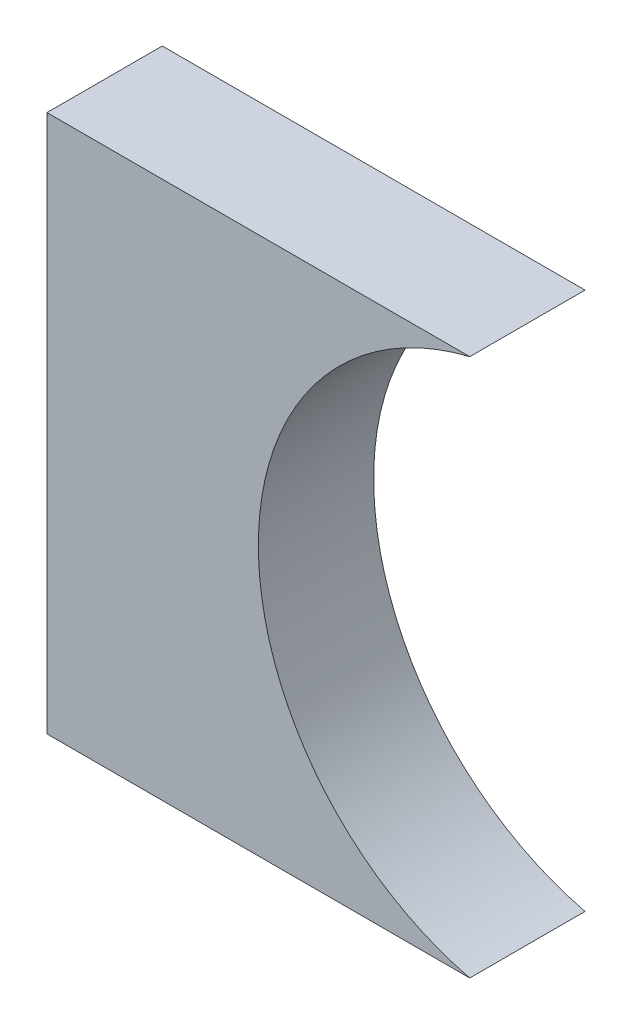
ISO-10303-21;
HEADER;
FILE_DESCRIPTION(('STEP AP214'),'2;1');
FILE_NAME('part.step','',(''),(''),'','','');
FILE_SCHEMA(('AUTOMOTIVE_DESIGN { 1 0 10303 214 1 1 1 1 }'));
ENDSEC;
DATA;
#1=APPLICATION_CONTEXT('core data for automotive mechanical design processes');
#2=APPLICATION_PROTOCOL_DEFINITION('international standard','automotive_design',2000,#1);
#3=PRODUCT_CONTEXT('',#1,'mechanical');
#4=PRODUCT('Part','Part','',(#3));
#5=PRODUCT_RELATED_PRODUCT_CATEGORY('part','',(#4));
#6=PRODUCT_DEFINITION_FORMATION('','',#4);
#7=PRODUCT_DEFINITION_CONTEXT('part definition',#1,'design');
#8=PRODUCT_DEFINITION('design','',#6,#7);
#9=PRODUCT_DEFINITION_SHAPE('','',#8);
#10=(LENGTH_UNIT() NAMED_UNIT(*) SI_UNIT(.MILLI.,.METRE.));
#11=(NAMED_UNIT(*) PLANE_ANGLE_UNIT() SI_UNIT($,.RADIAN.));
#12=(NAMED_UNIT(*) SI_UNIT($,.STERADIAN.) SOLID_ANGLE_UNIT());
#13=UNCERTAINTY_MEASURE_WITH_UNIT(LENGTH_MEASURE(1.E-05),#10,'distance_accuracy_value','');
#14=(GEOMETRIC_REPRESENTATION_CONTEXT(3) GLOBAL_UNCERTAINTY_ASSIGNED_CONTEXT((#13)) GLOBAL_UNIT_ASSIGNED_CONTEXT((#10,
#11,#12)) REPRESENTATION_CONTEXT('',''));
#15=CARTESIAN_POINT('',(0.,0.,0.));
#16=DIRECTION('',(0.,0.,1.));
#17=DIRECTION('',(1.,0.,0.));
#18=AXIS2_PLACEMENT_3D('',#15,#16,#17);
#19=CARTESIAN_POINT('',(45.7488636363636,0.,9.525));
#20=DIRECTION('',(0.,0.,-1.));
#21=DIRECTION('',(-1.,0.,0.));
#22=AXIS2_PLACEMENT_3D('',#19,#20,#21);
#23=CYLINDRICAL_SURFACE('',#22,45.7488636363636);
#24=CARTESIAN_POINT('',(45.7488636363636,0.,-9.525));
#25=DIRECTION('',(0.,0.,1.));
#26=DIRECTION('',(1.,0.,0.));
#27=AXIS2_PLACEMENT_3D('',#24,#25,#26);
#28=CIRCLE('',#27,45.7488636363636);
#29=CARTESIAN_POINT('',(34.925,44.45,-9.525));
#30=VERTEX_POINT('',#29);
#31=CARTESIAN_POINT('',(34.925,-44.45,-9.525));
#32=VERTEX_POINT('',#31);
#33=EDGE_CURVE('E97',#30,#32,#28,.T.);
#34=ORIENTED_EDGE('',*,*,#33,.F.);
#35=DIRECTION('',(0.,0.,-1.));
#36=VECTOR('',#35,1.);
#37=CARTESIAN_POINT('',(34.925,44.45,9.525));
#38=LINE('',#37,#36);
#39=CARTESIAN_POINT('',(34.925,44.45,9.525));
#40=VERTEX_POINT('',#39);
#41=EDGE_CURVE('E11',#40,#30,#38,.T.);
#42=ORIENTED_EDGE('',*,*,#41,.F.);
#43=CARTESIAN_POINT('',(45.7488636363636,0.,9.525));
#44=DIRECTION('',(0.,0.,1.));
#45=DIRECTION('',(1.,0.,0.));
#46=AXIS2_PLACEMENT_3D('',#43,#44,#45);
#47=CIRCLE('',#46,45.7488636363636);
#48=CARTESIAN_POINT('',(34.925,-44.45,9.525));
#49=VERTEX_POINT('',#48);
#50=EDGE_CURVE('E90',#40,#49,#47,.T.);
#51=ORIENTED_EDGE('',*,*,#50,.T.);
#52=DIRECTION('',(0.,0.,-1.));
#53=VECTOR('',#52,1.);
#54=CARTESIAN_POINT('',(34.925,-44.45,9.525));
#55=LINE('',#54,#53);
#56=EDGE_CURVE('E72',#49,#32,#55,.T.);
#57=ORIENTED_EDGE('',*,*,#56,.T.);
#58=EDGE_LOOP('',(#34,#42,#51,#57));
#59=FACE_BOUND('',#58,.T.);
#60=ADVANCED_FACE('F34',(#59),#23,.F.);
#61=CARTESIAN_POINT('',(0.,44.45,9.525));
#62=DIRECTION('',(0.,1.,0.));
#63=DIRECTION('',(0.,0.,1.));
#64=AXIS2_PLACEMENT_3D('',#61,#62,#63);
#65=PLANE('',#64);
#66=DIRECTION('',(1.,0.,0.));
#67=VECTOR('',#66,1.);
#68=CARTESIAN_POINT('',(0.,44.45,-9.525));
#69=LINE('',#68,#67);
#70=CARTESIAN_POINT('',(-34.925,44.45,-9.525));
#71=VERTEX_POINT('',#70);
#72=EDGE_CURVE('E83',#71,#30,#69,.T.);
#73=ORIENTED_EDGE('',*,*,#72,.F.);
#74=DIRECTION('',(0.,0.,-1.));
#75=VECTOR('',#74,1.);
#76=CARTESIAN_POINT('',(-34.925,44.45,9.525));
#77=LINE('',#76,#75);
#78=CARTESIAN_POINT('',(-34.925,44.45,9.525));
#79=VERTEX_POINT('',#78);
#80=EDGE_CURVE('E42',#79,#71,#77,.T.);
#81=ORIENTED_EDGE('',*,*,#80,.F.);
#82=DIRECTION('',(1.,0.,0.));
#83=VECTOR('',#82,1.);
#84=CARTESIAN_POINT('',(0.,44.45,9.525));
#85=LINE('',#84,#83);
#86=EDGE_CURVE('E81',#79,#40,#85,.T.);
#87=ORIENTED_EDGE('',*,*,#86,.T.);
#88=ORIENTED_EDGE('',*,*,#41,.T.);
#89=EDGE_LOOP('',(#73,#81,#87,#88));
#90=FACE_BOUND('',#89,.T.);
#91=ADVANCED_FACE('F80',(#90),#65,.T.);
#92=CARTESIAN_POINT('',(-34.925,0.,9.525));
#93=DIRECTION('',(-1.,0.,0.));
#94=DIRECTION('',(0.,0.,1.));
#95=AXIS2_PLACEMENT_3D('',#92,#93,#94);
#96=PLANE('',#95);
#97=DIRECTION('',(0.,1.,0.));
#98=VECTOR('',#97,1.);
#99=CARTESIAN_POINT('',(-34.925,0.,-9.525));
#100=LINE('',#99,#98);
#101=CARTESIAN_POINT('',(-34.925,-44.45,-9.525));
#102=VERTEX_POINT('',#101);
#103=EDGE_CURVE('E101',#102,#71,#100,.T.);
#104=ORIENTED_EDGE('',*,*,#103,.F.);
#105=DIRECTION('',(0.,0.,-1.));
#106=VECTOR('',#105,1.);
#107=CARTESIAN_POINT('',(-34.925,-44.45,9.525));
#108=LINE('',#107,#106);
#109=CARTESIAN_POINT('',(-34.925,-44.45,9.525));
#110=VERTEX_POINT('',#109);
#111=EDGE_CURVE('E65',#110,#102,#108,.T.);
#112=ORIENTED_EDGE('',*,*,#111,.F.);
#113=DIRECTION('',(0.,1.,0.));
#114=VECTOR('',#113,1.);
#115=CARTESIAN_POINT('',(-34.925,0.,9.525));
#116=LINE('',#115,#114);
#117=EDGE_CURVE('E89',#110,#79,#116,.T.);
#118=ORIENTED_EDGE('',*,*,#117,.T.);
#119=ORIENTED_EDGE('',*,*,#80,.T.);
#120=EDGE_LOOP('',(#104,#112,#118,#119));
#121=FACE_BOUND('',#120,.T.);
#122=ADVANCED_FACE('F92',(#121),#96,.T.);
#123=CARTESIAN_POINT('',(0.,-44.45,9.525));
#124=DIRECTION('',(0.,1.,0.));
#125=DIRECTION('',(0.,0.,1.));
#126=AXIS2_PLACEMENT_3D('',#123,#124,#125);
#127=PLANE('',#126);
#128=DIRECTION('',(1.,0.,0.));
#129=VECTOR('',#128,1.);
#130=CARTESIAN_POINT('',(0.,-44.45,-9.525));
#131=LINE('',#130,#129);
#132=EDGE_CURVE('E103',#102,#32,#131,.T.);
#133=ORIENTED_EDGE('',*,*,#132,.T.);
#134=ORIENTED_EDGE('',*,*,#56,.F.);
#135=DIRECTION('',(1.,0.,0.));
#136=VECTOR('',#135,1.);
#137=CARTESIAN_POINT('',(0.,-44.45,9.525));
#138=LINE('',#137,#136);
#139=EDGE_CURVE('E50',#110,#49,#138,.T.);
#140=ORIENTED_EDGE('',*,*,#139,.F.);
#141=ORIENTED_EDGE('',*,*,#111,.T.);
#142=EDGE_LOOP('',(#133,#134,#140,#141));
#143=FACE_BOUND('',#142,.T.);
#144=ADVANCED_FACE('F113',(#143),#127,.F.);
#145=CARTESIAN_POINT('',(0.,0.,9.525));
#146=DIRECTION('',(0.,0.,1.));
#147=DIRECTION('',(1.,0.,0.));
#148=AXIS2_PLACEMENT_3D('',#145,#146,#147);
#149=PLANE('',#148);
#150=ORIENTED_EDGE('',*,*,#50,.F.);
#151=ORIENTED_EDGE('',*,*,#86,.F.);
#152=ORIENTED_EDGE('',*,*,#117,.F.);
#153=ORIENTED_EDGE('',*,*,#139,.T.);
#154=EDGE_LOOP('',(#150,#151,#152,#153));
#155=FACE_BOUND('',#154,.T.);
#156=ADVANCED_FACE('F88',(#155),#149,.T.);
#157=CARTESIAN_POINT('',(0.,0.,-9.525));
#158=DIRECTION('',(0.,0.,1.));
#159=DIRECTION('',(1.,0.,0.));
#160=AXIS2_PLACEMENT_3D('',#157,#158,#159);
#161=PLANE('',#160);
#162=ORIENTED_EDGE('',*,*,#33,.T.);
#163=ORIENTED_EDGE('',*,*,#132,.F.);
#164=ORIENTED_EDGE('',*,*,#103,.T.);
#165=ORIENTED_EDGE('',*,*,#72,.T.);
#166=EDGE_LOOP('',(#162,#163,#164,#165));
#167=FACE_BOUND('',#166,.T.);
#168=ADVANCED_FACE('F118',(#167),#161,.F.);
#169=CLOSED_SHELL('',(#60,#91,#122,#144,#156,#168));
#170=MANIFOLD_SOLID_BREP('B2',#169);
#171=ADVANCED_BREP_SHAPE_REPRESENTATION('',(#18,#170),#14);
#172=SHAPE_DEFINITION_REPRESENTATION(#9,#171);
ENDSEC;
END-ISO-10303-21;
